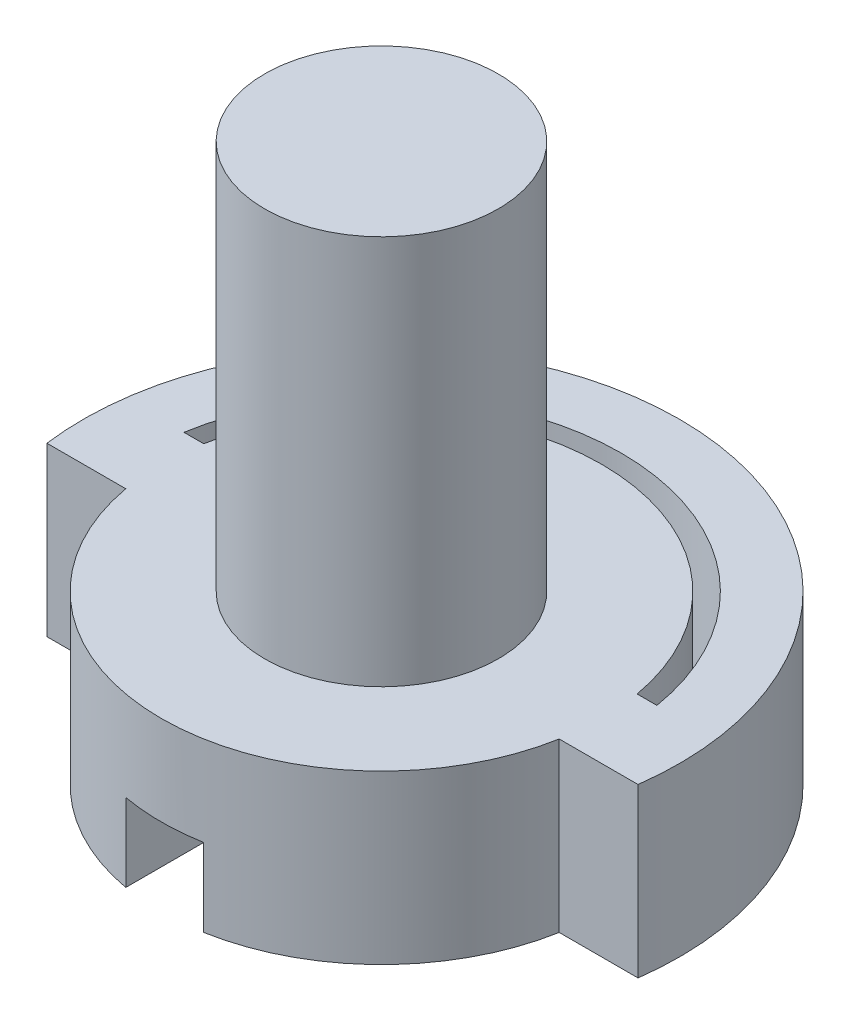
ISO-10303-21;
HEADER;
FILE_DESCRIPTION(('STEP AP214'),'2;1');
FILE_NAME('part.step','',(''),(''),'','','');
FILE_SCHEMA(('AUTOMOTIVE_DESIGN { 1 0 10303 214 1 1 1 1 }'));
ENDSEC;
DATA;
#1=APPLICATION_CONTEXT('core data for automotive mechanical design processes');
#2=APPLICATION_PROTOCOL_DEFINITION('international standard','automotive_design',2000,#1);
#3=PRODUCT_CONTEXT('',#1,'mechanical');
#4=PRODUCT('Part','Part','',(#3));
#5=PRODUCT_RELATED_PRODUCT_CATEGORY('part','',(#4));
#6=PRODUCT_DEFINITION_FORMATION('','',#4);
#7=PRODUCT_DEFINITION_CONTEXT('part definition',#1,'design');
#8=PRODUCT_DEFINITION('design','',#6,#7);
#9=PRODUCT_DEFINITION_SHAPE('','',#8);
#10=(LENGTH_UNIT() NAMED_UNIT(*) SI_UNIT(.MILLI.,.METRE.));
#11=(NAMED_UNIT(*) PLANE_ANGLE_UNIT() SI_UNIT($,.RADIAN.));
#12=(NAMED_UNIT(*) SI_UNIT($,.STERADIAN.) SOLID_ANGLE_UNIT());
#13=UNCERTAINTY_MEASURE_WITH_UNIT(LENGTH_MEASURE(1.E-05),#10,'distance_accuracy_value','');
#14=(GEOMETRIC_REPRESENTATION_CONTEXT(3) GLOBAL_UNCERTAINTY_ASSIGNED_CONTEXT((#13)) GLOBAL_UNIT_ASSIGNED_CONTEXT((#10,
#11,#12)) REPRESENTATION_CONTEXT('',''));
#15=CARTESIAN_POINT('',(0.,0.,0.));
#16=DIRECTION('',(0.,0.,1.));
#17=DIRECTION('',(1.,0.,0.));
#18=AXIS2_PLACEMENT_3D('',#15,#16,#17);
#19=CARTESIAN_POINT('',(0.,4.3,0.));
#20=DIRECTION('',(0.,-1.,0.));
#21=DIRECTION('',(0.,0.,-1.));
#22=AXIS2_PLACEMENT_3D('',#19,#20,#21);
#23=CYLINDRICAL_SURFACE('',#22,6.15);
#24=CARTESIAN_POINT('',(0.,0.,0.));
#25=DIRECTION('',(0.,1.,0.));
#26=DIRECTION('',(0.,0.,1.));
#27=AXIS2_PLACEMENT_3D('',#24,#25,#26);
#28=CIRCLE('',#27,6.15);
#29=CARTESIAN_POINT('',(6.06815457944176,0.,-1.));
#30=VERTEX_POINT('',#29);
#31=CARTESIAN_POINT('',(-6.06815457944176,0.,-1.));
#32=VERTEX_POINT('',#31);
#33=EDGE_CURVE('E160',#30,#32,#28,.T.);
#34=ORIENTED_EDGE('',*,*,#33,.F.);
#35=DIRECTION('',(0.,-1.,0.));
#36=VECTOR('',#35,1.);
#37=CARTESIAN_POINT('',(6.06815457944176,4.3,-1.));
#38=LINE('',#37,#36);
#39=CARTESIAN_POINT('',(6.06815457944176,4.3,-1.));
#40=VERTEX_POINT('',#39);
#41=EDGE_CURVE('E127',#40,#30,#38,.T.);
#42=ORIENTED_EDGE('',*,*,#41,.F.);
#43=CARTESIAN_POINT('',(0.,4.3,0.));
#44=DIRECTION('',(0.,1.,0.));
#45=DIRECTION('',(0.,0.,1.));
#46=AXIS2_PLACEMENT_3D('',#43,#44,#45);
#47=CIRCLE('',#46,6.15);
#48=CARTESIAN_POINT('',(-6.06815457944176,4.3,-1.));
#49=VERTEX_POINT('',#48);
#50=EDGE_CURVE('E140',#40,#49,#47,.T.);
#51=ORIENTED_EDGE('',*,*,#50,.T.);
#52=DIRECTION('',(0.,-1.,0.));
#53=VECTOR('',#52,1.);
#54=CARTESIAN_POINT('',(-6.06815457944176,4.3,-1.));
#55=LINE('',#54,#53);
#56=EDGE_CURVE('E59',#49,#32,#55,.T.);
#57=ORIENTED_EDGE('',*,*,#56,.T.);
#58=EDGE_LOOP('',(#34,#42,#51,#57));
#59=FACE_BOUND('',#58,.T.);
#60=ADVANCED_FACE('F35',(#59),#23,.F.);
#61=CARTESIAN_POINT('',(0.,4.3,-1.));
#62=DIRECTION('',(0.,0.,-1.));
#63=DIRECTION('',(-1.,0.,0.));
#64=AXIS2_PLACEMENT_3D('',#61,#62,#63);
#65=PLANE('',#64);
#66=DIRECTION('',(1.,0.,0.));
#67=VECTOR('',#66,1.);
#68=CARTESIAN_POINT('',(0.,0.,-1.));
#69=LINE('',#68,#67);
#70=CARTESIAN_POINT('',(5.5608003021148,0.,-1.));
#71=VERTEX_POINT('',#70);
#72=EDGE_CURVE('E123',#71,#30,#69,.T.);
#73=ORIENTED_EDGE('',*,*,#72,.F.);
#74=DIRECTION('',(0.,-1.,0.));
#75=VECTOR('',#74,1.);
#76=CARTESIAN_POINT('',(5.5608003021148,4.3,-1.));
#77=LINE('',#76,#75);
#78=CARTESIAN_POINT('',(5.5608003021148,4.3,-1.));
#79=VERTEX_POINT('',#78);
#80=EDGE_CURVE('E117',#79,#71,#77,.T.);
#81=ORIENTED_EDGE('',*,*,#80,.F.);
#82=DIRECTION('',(1.,0.,0.));
#83=VECTOR('',#82,1.);
#84=CARTESIAN_POINT('',(0.,4.3,-1.));
#85=LINE('',#84,#83);
#86=EDGE_CURVE('E121',#79,#40,#85,.T.);
#87=ORIENTED_EDGE('',*,*,#86,.T.);
#88=ORIENTED_EDGE('',*,*,#41,.T.);
#89=EDGE_LOOP('',(#73,#81,#87,#88));
#90=FACE_BOUND('',#89,.T.);
#91=ADVANCED_FACE('F119',(#90),#65,.T.);
#92=CARTESIAN_POINT('',(0.,4.3,0.));
#93=DIRECTION('',(0.,-1.,0.));
#94=DIRECTION('',(0.,0.,-1.));
#95=AXIS2_PLACEMENT_3D('',#92,#93,#94);
#96=CYLINDRICAL_SURFACE('',#95,5.65);
#97=CARTESIAN_POINT('',(0.,0.,0.));
#98=DIRECTION('',(0.,1.,0.));
#99=DIRECTION('',(0.,0.,1.));
#100=AXIS2_PLACEMENT_3D('',#97,#98,#99);
#101=CIRCLE('',#100,5.65);
#102=CARTESIAN_POINT('',(1.,0.,-5.5608003021148));
#103=VERTEX_POINT('',#102);
#104=EDGE_CURVE('E164',#71,#103,#101,.T.);
#105=ORIENTED_EDGE('',*,*,#104,.T.);
#106=DIRECTION('',(0.,-1.,0.));
#107=VECTOR('',#106,1.);
#108=CARTESIAN_POINT('',(1.,4.3,-5.56080030211479));
#109=LINE('',#108,#107);
#110=CARTESIAN_POINT('',(1.,2.,-5.5608003021148));
#111=VERTEX_POINT('',#110);
#112=EDGE_CURVE('E201',#103,#111,#109,.F.);
#113=ORIENTED_EDGE('',*,*,#112,.T.);
#114=CARTESIAN_POINT('',(0.,2.,0.));
#115=DIRECTION('',(0.,1.,0.));
#116=DIRECTION('',(0.,0.,1.));
#117=AXIS2_PLACEMENT_3D('',#114,#115,#116);
#118=CIRCLE('',#117,5.65);
#119=CARTESIAN_POINT('',(-1.,2.,-5.5608003021148));
#120=VERTEX_POINT('',#119);
#121=EDGE_CURVE('E204',#111,#120,#118,.T.);
#122=ORIENTED_EDGE('',*,*,#121,.T.);
#123=DIRECTION('',(0.,-1.,0.));
#124=VECTOR('',#123,1.);
#125=CARTESIAN_POINT('',(-1.,4.3,-5.56080030211479));
#126=LINE('',#125,#124);
#127=CARTESIAN_POINT('',(-1.,0.,-5.5608003021148));
#128=VERTEX_POINT('',#127);
#129=EDGE_CURVE('E210',#120,#128,#126,.T.);
#130=ORIENTED_EDGE('',*,*,#129,.T.);
#131=CARTESIAN_POINT('',(-5.5608003021148,0.,-1.));
#132=VERTEX_POINT('',#131);
#133=EDGE_CURVE('E163',#128,#132,#101,.T.);
#134=ORIENTED_EDGE('',*,*,#133,.T.);
#135=DIRECTION('',(0.,-1.,0.));
#136=VECTOR('',#135,1.);
#137=CARTESIAN_POINT('',(-5.5608003021148,4.3,-1.));
#138=LINE('',#137,#136);
#139=CARTESIAN_POINT('',(-5.5608003021148,4.3,-1.));
#140=VERTEX_POINT('',#139);
#141=EDGE_CURVE('E128',#140,#132,#138,.T.);
#142=ORIENTED_EDGE('',*,*,#141,.F.);
#143=CARTESIAN_POINT('',(0.,4.3,0.));
#144=DIRECTION('',(0.,1.,0.));
#145=DIRECTION('',(0.,0.,1.));
#146=AXIS2_PLACEMENT_3D('',#143,#144,#145);
#147=CIRCLE('',#146,5.65);
#148=EDGE_CURVE('E131',#79,#140,#147,.T.);
#149=ORIENTED_EDGE('',*,*,#148,.F.);
#150=ORIENTED_EDGE('',*,*,#80,.T.);
#151=EDGE_LOOP('',(#105,#113,#122,#130,#134,#142,#149,#150));
#152=FACE_BOUND('',#151,.T.);
#153=ADVANCED_FACE('F132',(#152),#96,.T.);
#154=CARTESIAN_POINT('',(0.,4.3,1.));
#155=DIRECTION('',(0.,0.,-1.));
#156=DIRECTION('',(-1.,0.,0.));
#157=AXIS2_PLACEMENT_3D('',#154,#155,#156);
#158=PLANE('',#157);
#159=DIRECTION('',(1.,0.,0.));
#160=VECTOR('',#159,1.);
#161=CARTESIAN_POINT('',(0.,0.,1.));
#162=LINE('',#161,#160);
#163=CARTESIAN_POINT('',(5.5608003021148,0.,1.));
#164=VERTEX_POINT('',#163);
#165=CARTESIAN_POINT('',(7.5843589050097,0.,1.));
#166=VERTEX_POINT('',#165);
#167=EDGE_CURVE('E148',#164,#166,#162,.T.);
#168=ORIENTED_EDGE('',*,*,#167,.T.);
#169=DIRECTION('',(0.,-1.,0.));
#170=VECTOR('',#169,1.);
#171=CARTESIAN_POINT('',(7.5843589050097,4.3,1.));
#172=LINE('',#171,#170);
#173=CARTESIAN_POINT('',(7.5843589050097,4.3,1.));
#174=VERTEX_POINT('',#173);
#175=EDGE_CURVE('E171',#174,#166,#172,.T.);
#176=ORIENTED_EDGE('',*,*,#175,.F.);
#177=DIRECTION('',(1.,0.,0.));
#178=VECTOR('',#177,1.);
#179=CARTESIAN_POINT('',(0.,4.3,1.));
#180=LINE('',#179,#178);
#181=CARTESIAN_POINT('',(5.5608003021148,4.3,1.));
#182=VERTEX_POINT('',#181);
#183=EDGE_CURVE('E169',#182,#174,#180,.T.);
#184=ORIENTED_EDGE('',*,*,#183,.F.);
#185=DIRECTION('',(0.,-1.,0.));
#186=VECTOR('',#185,1.);
#187=CARTESIAN_POINT('',(5.5608003021148,4.3,1.));
#188=LINE('',#187,#186);
#189=EDGE_CURVE('E147',#182,#164,#188,.T.);
#190=ORIENTED_EDGE('',*,*,#189,.T.);
#191=EDGE_LOOP('',(#168,#176,#184,#190));
#192=FACE_BOUND('',#191,.T.);
#193=ADVANCED_FACE('F37',(#192),#158,.F.);
#194=CARTESIAN_POINT('',(0.,4.3,0.));
#195=DIRECTION('',(0.,-1.,0.));
#196=DIRECTION('',(0.,0.,-1.));
#197=AXIS2_PLACEMENT_3D('',#194,#195,#196);
#198=CYLINDRICAL_SURFACE('',#197,7.65);
#199=CARTESIAN_POINT('',(0.,0.,0.));
#200=DIRECTION('',(0.,1.,0.));
#201=DIRECTION('',(0.,0.,1.));
#202=AXIS2_PLACEMENT_3D('',#199,#200,#201);
#203=CIRCLE('',#202,7.65);
#204=CARTESIAN_POINT('',(-7.5843589050097,0.,1.));
#205=VERTEX_POINT('',#204);
#206=EDGE_CURVE('E151',#166,#205,#203,.T.);
#207=ORIENTED_EDGE('',*,*,#206,.T.);
#208=DIRECTION('',(0.,-1.,0.));
#209=VECTOR('',#208,1.);
#210=CARTESIAN_POINT('',(-7.5843589050097,4.3,1.));
#211=LINE('',#210,#209);
#212=CARTESIAN_POINT('',(-7.5843589050097,4.3,1.));
#213=VERTEX_POINT('',#212);
#214=EDGE_CURVE('E180',#213,#205,#211,.T.);
#215=ORIENTED_EDGE('',*,*,#214,.F.);
#216=CARTESIAN_POINT('',(0.,4.3,0.));
#217=DIRECTION('',(0.,1.,0.));
#218=DIRECTION('',(0.,0.,1.));
#219=AXIS2_PLACEMENT_3D('',#216,#217,#218);
#220=CIRCLE('',#219,7.65);
#221=EDGE_CURVE('E99',#174,#213,#220,.T.);
#222=ORIENTED_EDGE('',*,*,#221,.F.);
#223=ORIENTED_EDGE('',*,*,#175,.T.);
#224=EDGE_LOOP('',(#207,#215,#222,#223));
#225=FACE_BOUND('',#224,.T.);
#226=ADVANCED_FACE('F231',(#225),#198,.T.);
#227=CARTESIAN_POINT('',(0.,4.3,1.));
#228=DIRECTION('',(0.,0.,-1.));
#229=DIRECTION('',(-1.,0.,0.));
#230=AXIS2_PLACEMENT_3D('',#227,#228,#229);
#231=PLANE('',#230);
#232=DIRECTION('',(1.,0.,0.));
#233=VECTOR('',#232,1.);
#234=CARTESIAN_POINT('',(0.,0.,1.));
#235=LINE('',#234,#233);
#236=CARTESIAN_POINT('',(-5.5608003021148,0.,1.));
#237=VERTEX_POINT('',#236);
#238=EDGE_CURVE('E154',#205,#237,#235,.T.);
#239=ORIENTED_EDGE('',*,*,#238,.T.);
#240=DIRECTION('',(0.,-1.,0.));
#241=VECTOR('',#240,1.);
#242=CARTESIAN_POINT('',(-5.5608003021148,4.3,1.));
#243=LINE('',#242,#241);
#244=CARTESIAN_POINT('',(-5.5608003021148,4.3,1.));
#245=VERTEX_POINT('',#244);
#246=EDGE_CURVE('E177',#245,#237,#243,.T.);
#247=ORIENTED_EDGE('',*,*,#246,.F.);
#248=DIRECTION('',(1.,0.,0.));
#249=VECTOR('',#248,1.);
#250=CARTESIAN_POINT('',(0.,4.3,1.));
#251=LINE('',#250,#249);
#252=EDGE_CURVE('E220',#213,#245,#251,.T.);
#253=ORIENTED_EDGE('',*,*,#252,.F.);
#254=ORIENTED_EDGE('',*,*,#214,.T.);
#255=EDGE_LOOP('',(#239,#247,#253,#254));
#256=FACE_BOUND('',#255,.T.);
#257=ADVANCED_FACE('F234',(#256),#231,.F.);
#258=CARTESIAN_POINT('',(0.,4.3,0.));
#259=DIRECTION('',(0.,-1.,0.));
#260=DIRECTION('',(0.,0.,-1.));
#261=AXIS2_PLACEMENT_3D('',#258,#259,#260);
#262=CYLINDRICAL_SURFACE('',#261,5.65);
#263=CARTESIAN_POINT('',(0.,2.,0.));
#264=DIRECTION('',(0.,1.,0.));
#265=DIRECTION('',(0.,0.,1.));
#266=AXIS2_PLACEMENT_3D('',#263,#264,#265);
#267=CIRCLE('',#266,5.65);
#268=CARTESIAN_POINT('',(-1.,2.,5.5608003021148));
#269=VERTEX_POINT('',#268);
#270=CARTESIAN_POINT('',(1.,2.,5.5608003021148));
#271=VERTEX_POINT('',#270);
#272=EDGE_CURVE('E11',#269,#271,#267,.T.);
#273=ORIENTED_EDGE('',*,*,#272,.T.);
#274=DIRECTION('',(0.,-1.,0.));
#275=VECTOR('',#274,1.);
#276=CARTESIAN_POINT('',(1.,4.3,5.56080030211479));
#277=LINE('',#276,#275);
#278=CARTESIAN_POINT('',(1.,0.,5.5608003021148));
#279=VERTEX_POINT('',#278);
#280=EDGE_CURVE('E206',#271,#279,#277,.T.);
#281=ORIENTED_EDGE('',*,*,#280,.T.);
#282=CARTESIAN_POINT('',(0.,0.,0.));
#283=DIRECTION('',(0.,1.,0.));
#284=DIRECTION('',(0.,0.,1.));
#285=AXIS2_PLACEMENT_3D('',#282,#283,#284);
#286=CIRCLE('',#285,5.65);
#287=EDGE_CURVE('E156',#279,#164,#286,.T.);
#288=ORIENTED_EDGE('',*,*,#287,.T.);
#289=ORIENTED_EDGE('',*,*,#189,.F.);
#290=CARTESIAN_POINT('',(0.,4.3,0.));
#291=DIRECTION('',(0.,1.,0.));
#292=DIRECTION('',(0.,0.,1.));
#293=AXIS2_PLACEMENT_3D('',#290,#291,#292);
#294=CIRCLE('',#293,5.65);
#295=EDGE_CURVE('E142',#245,#182,#294,.T.);
#296=ORIENTED_EDGE('',*,*,#295,.F.);
#297=ORIENTED_EDGE('',*,*,#246,.T.);
#298=CARTESIAN_POINT('',(-1.,0.,5.5608003021148));
#299=VERTEX_POINT('',#298);
#300=EDGE_CURVE('E157',#237,#299,#286,.T.);
#301=ORIENTED_EDGE('',*,*,#300,.T.);
#302=DIRECTION('',(0.,-1.,0.));
#303=VECTOR('',#302,1.);
#304=CARTESIAN_POINT('',(-1.,4.3,5.56080030211479));
#305=LINE('',#304,#303);
#306=EDGE_CURVE('E50',#299,#269,#305,.F.);
#307=ORIENTED_EDGE('',*,*,#306,.T.);
#308=EDGE_LOOP('',(#273,#281,#288,#289,#296,#297,#301,#307));
#309=FACE_BOUND('',#308,.T.);
#310=ADVANCED_FACE('F229',(#309),#262,.T.);
#311=CARTESIAN_POINT('',(0.,4.3,-1.));
#312=DIRECTION('',(0.,0.,-1.));
#313=DIRECTION('',(-1.,0.,0.));
#314=AXIS2_PLACEMENT_3D('',#311,#312,#313);
#315=PLANE('',#314);
#316=DIRECTION('',(1.,0.,0.));
#317=VECTOR('',#316,1.);
#318=CARTESIAN_POINT('',(0.,0.,-1.));
#319=LINE('',#318,#317);
#320=EDGE_CURVE('E166',#32,#132,#319,.T.);
#321=ORIENTED_EDGE('',*,*,#320,.F.);
#322=ORIENTED_EDGE('',*,*,#56,.F.);
#323=DIRECTION('',(1.,0.,0.));
#324=VECTOR('',#323,1.);
#325=CARTESIAN_POINT('',(0.,4.3,-1.));
#326=LINE('',#325,#324);
#327=EDGE_CURVE('E136',#49,#140,#326,.T.);
#328=ORIENTED_EDGE('',*,*,#327,.T.);
#329=ORIENTED_EDGE('',*,*,#141,.T.);
#330=EDGE_LOOP('',(#321,#322,#328,#329));
#331=FACE_BOUND('',#330,.T.);
#332=ADVANCED_FACE('F256',(#331),#315,.T.);
#333=CARTESIAN_POINT('',(0.,4.3,0.));
#334=DIRECTION('',(0.,1.,0.));
#335=DIRECTION('',(0.,0.,1.));
#336=AXIS2_PLACEMENT_3D('',#333,#334,#335);
#337=PLANE('',#336);
#338=CARTESIAN_POINT('',(0.,4.3,0.));
#339=DIRECTION('',(0.,1.,0.));
#340=DIRECTION('',(0.,0.,1.));
#341=AXIS2_PLACEMENT_3D('',#338,#339,#340);
#342=CIRCLE('',#341,3.);
#343=CARTESIAN_POINT('',(0.,4.3,3.));
#344=VERTEX_POINT('',#343);
#345=EDGE_CURVE('E208',#344,#344,#342,.T.);
#346=ORIENTED_EDGE('',*,*,#345,.F.);
#347=EDGE_LOOP('',(#346));
#348=FACE_BOUND('',#347,.T.);
#349=ORIENTED_EDGE('',*,*,#183,.T.);
#350=ORIENTED_EDGE('',*,*,#221,.T.);
#351=ORIENTED_EDGE('',*,*,#252,.T.);
#352=ORIENTED_EDGE('',*,*,#295,.T.);
#353=EDGE_LOOP('',(#349,#350,#351,#352));
#354=FACE_BOUND('',#353,.T.);
#355=ORIENTED_EDGE('',*,*,#50,.F.);
#356=ORIENTED_EDGE('',*,*,#86,.F.);
#357=ORIENTED_EDGE('',*,*,#148,.T.);
#358=ORIENTED_EDGE('',*,*,#327,.F.);
#359=EDGE_LOOP('',(#355,#356,#357,#358));
#360=FACE_BOUND('',#359,.T.);
#361=ADVANCED_FACE('F139',(#348,#354,#360),#337,.T.);
#362=CARTESIAN_POINT('',(0.,0.,0.));
#363=DIRECTION('',(0.,1.,0.));
#364=DIRECTION('',(0.,0.,1.));
#365=AXIS2_PLACEMENT_3D('',#362,#363,#364);
#366=PLANE('',#365);
#367=ORIENTED_EDGE('',*,*,#287,.F.);
#368=DIRECTION('',(0.,0.,-1.));
#369=VECTOR('',#368,1.);
#370=CARTESIAN_POINT('',(1.,0.,0.));
#371=LINE('',#370,#369);
#372=EDGE_CURVE('E43',#279,#103,#371,.T.);
#373=ORIENTED_EDGE('',*,*,#372,.T.);
#374=ORIENTED_EDGE('',*,*,#104,.F.);
#375=ORIENTED_EDGE('',*,*,#72,.T.);
#376=ORIENTED_EDGE('',*,*,#33,.T.);
#377=ORIENTED_EDGE('',*,*,#320,.T.);
#378=ORIENTED_EDGE('',*,*,#133,.F.);
#379=DIRECTION('',(0.,0.,1.));
#380=VECTOR('',#379,1.);
#381=CARTESIAN_POINT('',(-1.,0.,0.));
#382=LINE('',#381,#380);
#383=EDGE_CURVE('E174',#128,#299,#382,.T.);
#384=ORIENTED_EDGE('',*,*,#383,.T.);
#385=ORIENTED_EDGE('',*,*,#300,.F.);
#386=ORIENTED_EDGE('',*,*,#238,.F.);
#387=ORIENTED_EDGE('',*,*,#206,.F.);
#388=ORIENTED_EDGE('',*,*,#167,.F.);
#389=EDGE_LOOP('',(#367,#373,#374,#375,#376,#377,#378,#384,#385,#386,#387,#388));
#390=FACE_BOUND('',#389,.T.);
#391=ADVANCED_FACE('F189',(#390),#366,.F.);
#392=CARTESIAN_POINT('',(0.,14.3,0.));
#393=DIRECTION('',(0.,-1.,0.));
#394=DIRECTION('',(0.,0.,-1.));
#395=AXIS2_PLACEMENT_3D('',#392,#393,#394);
#396=CYLINDRICAL_SURFACE('',#395,3.);
#397=CARTESIAN_POINT('',(0.,14.3,0.));
#398=DIRECTION('',(0.,1.,0.));
#399=DIRECTION('',(0.,0.,1.));
#400=AXIS2_PLACEMENT_3D('',#397,#398,#399);
#401=CIRCLE('',#400,3.);
#402=CARTESIAN_POINT('',(0.,14.3,3.));
#403=VERTEX_POINT('',#402);
#404=EDGE_CURVE('E152',#403,#403,#401,.T.);
#405=ORIENTED_EDGE('',*,*,#404,.F.);
#406=EDGE_LOOP('',(#405));
#407=FACE_BOUND('',#406,.T.);
#408=ORIENTED_EDGE('',*,*,#345,.T.);
#409=EDGE_LOOP('',(#408));
#410=FACE_BOUND('',#409,.T.);
#411=ADVANCED_FACE('F327',(#407,#410),#396,.T.);
#412=CARTESIAN_POINT('',(0.,14.3,0.));
#413=DIRECTION('',(0.,1.,0.));
#414=DIRECTION('',(0.,0.,1.));
#415=AXIS2_PLACEMENT_3D('',#412,#413,#414);
#416=PLANE('',#415);
#417=ORIENTED_EDGE('',*,*,#404,.T.);
#418=EDGE_LOOP('',(#417));
#419=FACE_BOUND('',#418,.T.);
#420=ADVANCED_FACE('F331',(#419),#416,.T.);
#421=CARTESIAN_POINT('',(0.,2.,0.));
#422=DIRECTION('',(0.,1.,0.));
#423=DIRECTION('',(0.,0.,1.));
#424=AXIS2_PLACEMENT_3D('',#421,#422,#423);
#425=PLANE('',#424);
#426=DIRECTION('',(0.,0.,1.));
#427=VECTOR('',#426,1.);
#428=CARTESIAN_POINT('',(1.,2.,-5.93549629863884));
#429=LINE('',#428,#427);
#430=EDGE_CURVE('E244',#111,#271,#429,.T.);
#431=ORIENTED_EDGE('',*,*,#430,.T.);
#432=ORIENTED_EDGE('',*,*,#272,.F.);
#433=DIRECTION('',(0.,0.,-1.));
#434=VECTOR('',#433,1.);
#435=CARTESIAN_POINT('',(-1.,2.,-5.93549629863884));
#436=LINE('',#435,#434);
#437=EDGE_CURVE('E241',#269,#120,#436,.T.);
#438=ORIENTED_EDGE('',*,*,#437,.T.);
#439=ORIENTED_EDGE('',*,*,#121,.F.);
#440=EDGE_LOOP('',(#431,#432,#438,#439));
#441=FACE_BOUND('',#440,.T.);
#442=ADVANCED_FACE('F249',(#441),#425,.F.);
#443=CARTESIAN_POINT('',(1.,2.,-5.93549629863884));
#444=DIRECTION('',(1.,0.,0.));
#445=DIRECTION('',(0.,0.,-1.));
#446=AXIS2_PLACEMENT_3D('',#443,#444,#445);
#447=PLANE('',#446);
#448=ORIENTED_EDGE('',*,*,#372,.F.);
#449=ORIENTED_EDGE('',*,*,#280,.F.);
#450=ORIENTED_EDGE('',*,*,#430,.F.);
#451=ORIENTED_EDGE('',*,*,#112,.F.);
#452=EDGE_LOOP('',(#448,#449,#450,#451));
#453=FACE_BOUND('',#452,.T.);
#454=ADVANCED_FACE('F250',(#453),#447,.F.);
#455=CARTESIAN_POINT('',(-1.,2.,-5.93549629863884));
#456=DIRECTION('',(-1.,0.,0.));
#457=DIRECTION('',(0.,0.,1.));
#458=AXIS2_PLACEMENT_3D('',#455,#456,#457);
#459=PLANE('',#458);
#460=ORIENTED_EDGE('',*,*,#437,.F.);
#461=ORIENTED_EDGE('',*,*,#306,.F.);
#462=ORIENTED_EDGE('',*,*,#383,.F.);
#463=ORIENTED_EDGE('',*,*,#129,.F.);
#464=EDGE_LOOP('',(#460,#461,#462,#463));
#465=FACE_BOUND('',#464,.T.);
#466=ADVANCED_FACE('F255',(#465),#459,.F.);
#467=CLOSED_SHELL('',(#60,#91,#153,#193,#226,#257,#310,#332,#361,#391,#411,#420,#442,#454,#466));
#468=MANIFOLD_SOLID_BREP('B2',#467);
#469=ADVANCED_BREP_SHAPE_REPRESENTATION('',(#18,#468),#14);
#470=SHAPE_DEFINITION_REPRESENTATION(#9,#469);
ENDSEC;
END-ISO-10303-21;
